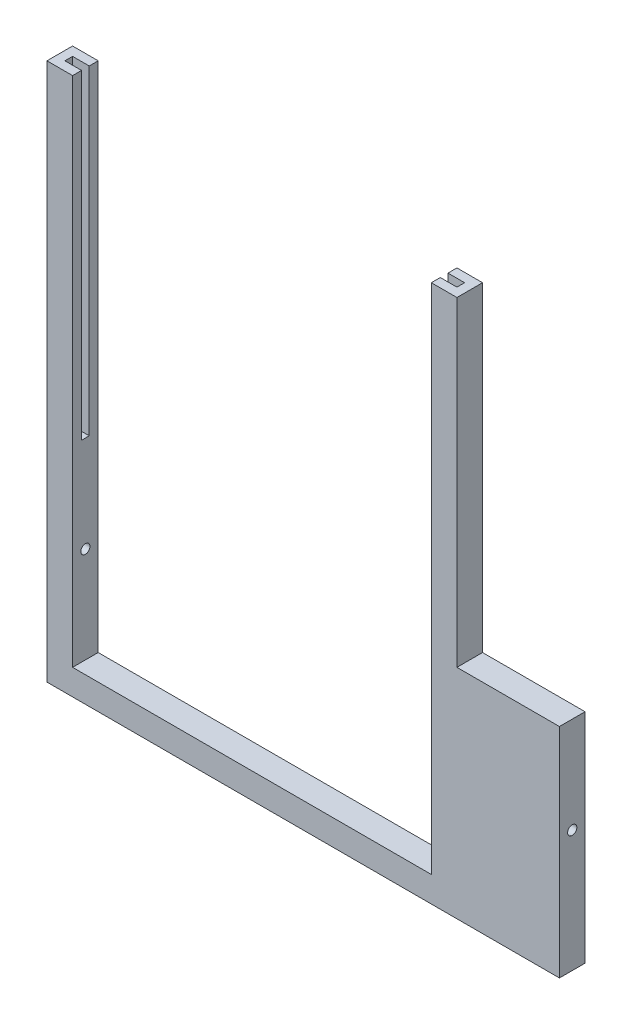
ISO-10303-21;
HEADER;
FILE_DESCRIPTION(('STEP AP214'),'2;1');
FILE_NAME('part.step','',(''),(''),'','','');
FILE_SCHEMA(('AUTOMOTIVE_DESIGN { 1 0 10303 214 1 1 1 1 }'));
ENDSEC;
DATA;
#1=APPLICATION_CONTEXT('core data for automotive mechanical design processes');
#2=APPLICATION_PROTOCOL_DEFINITION('international standard','automotive_design',2000,#1);
#3=PRODUCT_CONTEXT('',#1,'mechanical');
#4=PRODUCT('Part','Part','',(#3));
#5=PRODUCT_RELATED_PRODUCT_CATEGORY('part','',(#4));
#6=PRODUCT_DEFINITION_FORMATION('','',#4);
#7=PRODUCT_DEFINITION_CONTEXT('part definition',#1,'design');
#8=PRODUCT_DEFINITION('design','',#6,#7);
#9=PRODUCT_DEFINITION_SHAPE('','',#8);
#10=(LENGTH_UNIT() NAMED_UNIT(*) SI_UNIT(.MILLI.,.METRE.));
#11=(NAMED_UNIT(*) PLANE_ANGLE_UNIT() SI_UNIT($,.RADIAN.));
#12=(NAMED_UNIT(*) SI_UNIT($,.STERADIAN.) SOLID_ANGLE_UNIT());
#13=UNCERTAINTY_MEASURE_WITH_UNIT(LENGTH_MEASURE(1.E-05),#10,'distance_accuracy_value','');
#14=(GEOMETRIC_REPRESENTATION_CONTEXT(3) GLOBAL_UNCERTAINTY_ASSIGNED_CONTEXT((#13)) GLOBAL_UNIT_ASSIGNED_CONTEXT((#10,
#11,#12)) REPRESENTATION_CONTEXT('',''));
#15=CARTESIAN_POINT('',(0.,0.,0.));
#16=DIRECTION('',(0.,0.,1.));
#17=DIRECTION('',(1.,0.,0.));
#18=AXIS2_PLACEMENT_3D('',#15,#16,#17);
#19=CARTESIAN_POINT('',(30.,17.,2.));
#20=DIRECTION('',(0.,1.,0.));
#21=DIRECTION('',(0.,0.,1.));
#22=AXIS2_PLACEMENT_3D('',#19,#20,#21);
#23=PLANE('',#22);
#24=DIRECTION('',(0.,0.,1.));
#25=VECTOR('',#24,1.);
#26=CARTESIAN_POINT('',(31.3,17.,0.7));
#27=LINE('',#26,#25);
#28=CARTESIAN_POINT('',(31.3,17.,0.7));
#29=VERTEX_POINT('',#28);
#30=CARTESIAN_POINT('',(31.3,17.,1.3));
#31=VERTEX_POINT('',#30);
#32=EDGE_CURVE('E281',#29,#31,#27,.T.);
#33=ORIENTED_EDGE('',*,*,#32,.F.);
#34=DIRECTION('',(1.,0.,0.));
#35=VECTOR('',#34,1.);
#36=CARTESIAN_POINT('',(30.,17.,0.7));
#37=LINE('',#36,#35);
#38=CARTESIAN_POINT('',(30.,17.,0.7));
#39=VERTEX_POINT('',#38);
#40=EDGE_CURVE('E183',#39,#29,#37,.T.);
#41=ORIENTED_EDGE('',*,*,#40,.F.);
#42=DIRECTION('',(0.,0.,-1.));
#43=VECTOR('',#42,1.);
#44=CARTESIAN_POINT('',(30.,17.,2.));
#45=LINE('',#44,#43);
#46=CARTESIAN_POINT('',(30.,17.,1.3));
#47=VERTEX_POINT('',#46);
#48=EDGE_CURVE('E215',#47,#39,#45,.T.);
#49=ORIENTED_EDGE('',*,*,#48,.F.);
#50=DIRECTION('',(-1.,0.,0.));
#51=VECTOR('',#50,1.);
#52=CARTESIAN_POINT('',(31.3,17.,1.3));
#53=LINE('',#52,#51);
#54=EDGE_CURVE('E284',#31,#47,#53,.T.);
#55=ORIENTED_EDGE('',*,*,#54,.F.);
#56=EDGE_LOOP('',(#33,#41,#49,#55));
#57=FACE_BOUND('',#56,.T.);
#58=ADVANCED_FACE('F39',(#57),#23,.T.);
#59=CARTESIAN_POINT('',(0.,17.,2.));
#60=DIRECTION('',(0.,1.,0.));
#61=DIRECTION('',(0.,0.,1.));
#62=AXIS2_PLACEMENT_3D('',#59,#60,#61);
#63=PLANE('',#62);
#64=DIRECTION('',(0.,0.,-1.));
#65=VECTOR('',#64,1.);
#66=CARTESIAN_POINT('',(0.7,17.,1.3));
#67=LINE('',#66,#65);
#68=CARTESIAN_POINT('',(0.7,17.,1.3));
#69=VERTEX_POINT('',#68);
#70=CARTESIAN_POINT('',(0.7,17.,0.7));
#71=VERTEX_POINT('',#70);
#72=EDGE_CURVE('E335',#69,#71,#67,.T.);
#73=ORIENTED_EDGE('',*,*,#72,.F.);
#74=DIRECTION('',(-1.,0.,0.));
#75=VECTOR('',#74,1.);
#76=CARTESIAN_POINT('',(2.,17.,1.3));
#77=LINE('',#76,#75);
#78=CARTESIAN_POINT('',(2.,17.,1.3));
#79=VERTEX_POINT('',#78);
#80=EDGE_CURVE('E301',#79,#69,#77,.T.);
#81=ORIENTED_EDGE('',*,*,#80,.F.);
#82=DIRECTION('',(0.,0.,-1.));
#83=VECTOR('',#82,1.);
#84=CARTESIAN_POINT('',(2.,17.,2.));
#85=LINE('',#84,#83);
#86=CARTESIAN_POINT('',(2.,17.,0.7));
#87=VERTEX_POINT('',#86);
#88=EDGE_CURVE('E223',#79,#87,#85,.T.);
#89=ORIENTED_EDGE('',*,*,#88,.T.);
#90=DIRECTION('',(1.,0.,0.));
#91=VECTOR('',#90,1.);
#92=CARTESIAN_POINT('',(0.7,17.,0.7));
#93=LINE('',#92,#91);
#94=EDGE_CURVE('E307',#71,#87,#93,.T.);
#95=ORIENTED_EDGE('',*,*,#94,.F.);
#96=EDGE_LOOP('',(#73,#81,#89,#95));
#97=FACE_BOUND('',#96,.T.);
#98=ADVANCED_FACE('F41',(#97),#63,.T.);
#99=CARTESIAN_POINT('',(0.,0.,2.));
#100=DIRECTION('',(-1.,0.,0.));
#101=DIRECTION('',(0.,0.,1.));
#102=AXIS2_PLACEMENT_3D('',#99,#100,#101);
#103=PLANE('',#102);
#104=CARTESIAN_POINT('',(0.,9.5,1.));
#105=DIRECTION('',(1.,0.,0.));
#106=DIRECTION('',(0.,0.,-1.));
#107=AXIS2_PLACEMENT_3D('',#104,#105,#106);
#108=CIRCLE('',#107,0.36);
#109=CARTESIAN_POINT('',(0.,9.5,0.64));
#110=VERTEX_POINT('',#109);
#111=EDGE_CURVE('E353',#110,#110,#108,.T.);
#112=ORIENTED_EDGE('',*,*,#111,.T.);
#113=EDGE_LOOP('',(#112));
#114=FACE_BOUND('',#113,.T.);
#115=DIRECTION('',(0.,1.,0.));
#116=VECTOR('',#115,1.);
#117=CARTESIAN_POINT('',(0.,0.,0.));
#118=LINE('',#117,#116);
#119=CARTESIAN_POINT('',(0.,0.,0.));
#120=VERTEX_POINT('',#119);
#121=CARTESIAN_POINT('',(0.,42.,0.));
#122=VERTEX_POINT('',#121);
#123=EDGE_CURVE('E203',#120,#122,#118,.T.);
#124=ORIENTED_EDGE('',*,*,#123,.F.);
#125=DIRECTION('',(0.,0.,-1.));
#126=VECTOR('',#125,1.);
#127=CARTESIAN_POINT('',(0.,0.,2.));
#128=LINE('',#127,#126);
#129=CARTESIAN_POINT('',(0.,0.,2.));
#130=VERTEX_POINT('',#129);
#131=EDGE_CURVE('E11',#130,#120,#128,.T.);
#132=ORIENTED_EDGE('',*,*,#131,.F.);
#133=DIRECTION('',(0.,1.,0.));
#134=VECTOR('',#133,1.);
#135=CARTESIAN_POINT('',(0.,0.,2.));
#136=LINE('',#135,#134);
#137=CARTESIAN_POINT('',(0.,42.,2.));
#138=VERTEX_POINT('',#137);
#139=EDGE_CURVE('E226',#130,#138,#136,.T.);
#140=ORIENTED_EDGE('',*,*,#139,.T.);
#141=DIRECTION('',(0.,0.,1.));
#142=VECTOR('',#141,1.);
#143=CARTESIAN_POINT('',(0.,42.,0.));
#144=LINE('',#143,#142);
#145=EDGE_CURVE('E321',#122,#138,#144,.T.);
#146=ORIENTED_EDGE('',*,*,#145,.F.);
#147=EDGE_LOOP('',(#124,#132,#140,#146));
#148=FACE_BOUND('',#147,.T.);
#149=ADVANCED_FACE('F377',(#114,#148),#103,.T.);
#150=CARTESIAN_POINT('',(0.,0.,2.));
#151=DIRECTION('',(0.,1.,0.));
#152=DIRECTION('',(0.,0.,1.));
#153=AXIS2_PLACEMENT_3D('',#150,#151,#152);
#154=PLANE('',#153);
#155=DIRECTION('',(1.,0.,0.));
#156=VECTOR('',#155,1.);
#157=CARTESIAN_POINT('',(0.,0.,0.));
#158=LINE('',#157,#156);
#159=CARTESIAN_POINT('',(40.,0.,0.));
#160=VERTEX_POINT('',#159);
#161=EDGE_CURVE('E198',#120,#160,#158,.T.);
#162=ORIENTED_EDGE('',*,*,#161,.T.);
#163=DIRECTION('',(0.,0.,-1.));
#164=VECTOR('',#163,1.);
#165=CARTESIAN_POINT('',(40.,0.,2.));
#166=LINE('',#165,#164);
#167=CARTESIAN_POINT('',(40.,0.,2.));
#168=VERTEX_POINT('',#167);
#169=EDGE_CURVE('E49',#168,#160,#166,.T.);
#170=ORIENTED_EDGE('',*,*,#169,.F.);
#171=DIRECTION('',(1.,0.,0.));
#172=VECTOR('',#171,1.);
#173=CARTESIAN_POINT('',(0.,0.,2.));
#174=LINE('',#173,#172);
#175=EDGE_CURVE('E232',#130,#168,#174,.T.);
#176=ORIENTED_EDGE('',*,*,#175,.F.);
#177=ORIENTED_EDGE('',*,*,#131,.T.);
#178=EDGE_LOOP('',(#162,#170,#176,#177));
#179=FACE_BOUND('',#178,.T.);
#180=ADVANCED_FACE('F376',(#179),#154,.F.);
#181=CARTESIAN_POINT('',(40.,0.,2.));
#182=DIRECTION('',(-1.,0.,0.));
#183=DIRECTION('',(0.,0.,1.));
#184=AXIS2_PLACEMENT_3D('',#181,#182,#183);
#185=PLANE('',#184);
#186=CARTESIAN_POINT('',(40.,9.5,1.));
#187=DIRECTION('',(-1.,0.,0.));
#188=DIRECTION('',(0.,0.,1.));
#189=AXIS2_PLACEMENT_3D('',#186,#187,#188);
#190=CIRCLE('',#189,0.36);
#191=CARTESIAN_POINT('',(40.,9.5,1.36));
#192=VERTEX_POINT('',#191);
#193=EDGE_CURVE('E245',#192,#192,#190,.T.);
#194=ORIENTED_EDGE('',*,*,#193,.T.);
#195=EDGE_LOOP('',(#194));
#196=FACE_BOUND('',#195,.T.);
#197=DIRECTION('',(0.,1.,0.));
#198=VECTOR('',#197,1.);
#199=CARTESIAN_POINT('',(40.,0.,0.));
#200=LINE('',#199,#198);
#201=CARTESIAN_POINT('',(40.,17.,0.));
#202=VERTEX_POINT('',#201);
#203=EDGE_CURVE('E189',#160,#202,#200,.T.);
#204=ORIENTED_EDGE('',*,*,#203,.T.);
#205=DIRECTION('',(0.,0.,1.));
#206=VECTOR('',#205,1.);
#207=CARTESIAN_POINT('',(40.,17.,-0.00100000000000013));
#208=LINE('',#207,#206);
#209=CARTESIAN_POINT('',(40.,17.,2.));
#210=VERTEX_POINT('',#209);
#211=EDGE_CURVE('E172',#202,#210,#208,.T.);
#212=ORIENTED_EDGE('',*,*,#211,.T.);
#213=DIRECTION('',(0.,1.,0.));
#214=VECTOR('',#213,1.);
#215=CARTESIAN_POINT('',(40.,0.,2.));
#216=LINE('',#215,#214);
#217=EDGE_CURVE('E238',#168,#210,#216,.T.);
#218=ORIENTED_EDGE('',*,*,#217,.F.);
#219=ORIENTED_EDGE('',*,*,#169,.T.);
#220=EDGE_LOOP('',(#204,#212,#218,#219));
#221=FACE_BOUND('',#220,.T.);
#222=ADVANCED_FACE('F195',(#196,#221),#185,.F.);
#223=CARTESIAN_POINT('',(30.,2.,2.));
#224=DIRECTION('',(-1.,0.,0.));
#225=DIRECTION('',(0.,0.,1.));
#226=AXIS2_PLACEMENT_3D('',#223,#224,#225);
#227=PLANE('',#226);
#228=CARTESIAN_POINT('',(30.,9.5,1.));
#229=DIRECTION('',(-1.,0.,0.));
#230=DIRECTION('',(0.,0.,1.));
#231=AXIS2_PLACEMENT_3D('',#228,#229,#230);
#232=CIRCLE('',#231,0.36);
#233=CARTESIAN_POINT('',(30.,9.5,1.36));
#234=VERTEX_POINT('',#233);
#235=EDGE_CURVE('E357',#234,#234,#232,.T.);
#236=ORIENTED_EDGE('',*,*,#235,.F.);
#237=EDGE_LOOP('',(#236));
#238=FACE_BOUND('',#237,.T.);
#239=DIRECTION('',(0.,1.,0.));
#240=VECTOR('',#239,1.);
#241=CARTESIAN_POINT('',(30.,2.,0.));
#242=LINE('',#241,#240);
#243=CARTESIAN_POINT('',(30.,2.,0.));
#244=VERTEX_POINT('',#243);
#245=CARTESIAN_POINT('',(30.,42.,0.));
#246=VERTEX_POINT('',#245);
#247=EDGE_CURVE('E199',#244,#246,#242,.T.);
#248=ORIENTED_EDGE('',*,*,#247,.F.);
#249=DIRECTION('',(0.,0.,-1.));
#250=VECTOR('',#249,1.);
#251=CARTESIAN_POINT('',(30.,2.,2.));
#252=LINE('',#251,#250);
#253=CARTESIAN_POINT('',(30.,2.,2.));
#254=VERTEX_POINT('',#253);
#255=EDGE_CURVE('E219',#254,#244,#252,.T.);
#256=ORIENTED_EDGE('',*,*,#255,.F.);
#257=DIRECTION('',(0.,1.,0.));
#258=VECTOR('',#257,1.);
#259=CARTESIAN_POINT('',(30.,2.,2.));
#260=LINE('',#259,#258);
#261=CARTESIAN_POINT('',(30.,42.,2.));
#262=VERTEX_POINT('',#261);
#263=EDGE_CURVE('E369',#254,#262,#260,.T.);
#264=ORIENTED_EDGE('',*,*,#263,.T.);
#265=DIRECTION('',(0.,0.,1.));
#266=VECTOR('',#265,1.);
#267=CARTESIAN_POINT('',(30.,42.,1.3));
#268=LINE('',#267,#266);
#269=CARTESIAN_POINT('',(30.,42.,1.3));
#270=VERTEX_POINT('',#269);
#271=EDGE_CURVE('E287',#270,#262,#268,.T.);
#272=ORIENTED_EDGE('',*,*,#271,.F.);
#273=DIRECTION('',(0.,-1.,0.));
#274=VECTOR('',#273,1.);
#275=CARTESIAN_POINT('',(30.,42.,1.3));
#276=LINE('',#275,#274);
#277=EDGE_CURVE('E278',#270,#47,#276,.T.);
#278=ORIENTED_EDGE('',*,*,#277,.T.);
#279=ORIENTED_EDGE('',*,*,#48,.T.);
#280=DIRECTION('',(0.,-1.,0.));
#281=VECTOR('',#280,1.);
#282=CARTESIAN_POINT('',(30.,42.,0.7));
#283=LINE('',#282,#281);
#284=CARTESIAN_POINT('',(30.,42.,0.7));
#285=VERTEX_POINT('',#284);
#286=EDGE_CURVE('E258',#285,#39,#283,.T.);
#287=ORIENTED_EDGE('',*,*,#286,.F.);
#288=DIRECTION('',(0.,0.,1.));
#289=VECTOR('',#288,1.);
#290=CARTESIAN_POINT('',(30.,42.,0.));
#291=LINE('',#290,#289);
#292=EDGE_CURVE('E257',#246,#285,#291,.T.);
#293=ORIENTED_EDGE('',*,*,#292,.F.);
#294=EDGE_LOOP('',(#248,#256,#264,#272,#278,#279,#287,#293));
#295=FACE_BOUND('',#294,.T.);
#296=ADVANCED_FACE('F255',(#238,#295),#227,.T.);
#297=CARTESIAN_POINT('',(2.,2.,2.));
#298=DIRECTION('',(0.,1.,0.));
#299=DIRECTION('',(0.,0.,1.));
#300=AXIS2_PLACEMENT_3D('',#297,#298,#299);
#301=PLANE('',#300);
#302=DIRECTION('',(1.,0.,0.));
#303=VECTOR('',#302,1.);
#304=CARTESIAN_POINT('',(2.,2.,0.));
#305=LINE('',#304,#303);
#306=CARTESIAN_POINT('',(2.,2.,0.));
#307=VERTEX_POINT('',#306);
#308=EDGE_CURVE('E206',#307,#244,#305,.T.);
#309=ORIENTED_EDGE('',*,*,#308,.F.);
#310=DIRECTION('',(0.,0.,-1.));
#311=VECTOR('',#310,1.);
#312=CARTESIAN_POINT('',(2.,2.,2.));
#313=LINE('',#312,#311);
#314=CARTESIAN_POINT('',(2.,2.,2.));
#315=VERTEX_POINT('',#314);
#316=EDGE_CURVE('E89',#315,#307,#313,.T.);
#317=ORIENTED_EDGE('',*,*,#316,.F.);
#318=DIRECTION('',(1.,0.,0.));
#319=VECTOR('',#318,1.);
#320=CARTESIAN_POINT('',(2.,2.,2.));
#321=LINE('',#320,#319);
#322=EDGE_CURVE('E252',#315,#254,#321,.T.);
#323=ORIENTED_EDGE('',*,*,#322,.T.);
#324=ORIENTED_EDGE('',*,*,#255,.T.);
#325=EDGE_LOOP('',(#309,#317,#323,#324));
#326=FACE_BOUND('',#325,.T.);
#327=ADVANCED_FACE('F251',(#326),#301,.T.);
#328=CARTESIAN_POINT('',(2.,17.,2.));
#329=DIRECTION('',(1.,0.,0.));
#330=DIRECTION('',(0.,1.,0.));
#331=AXIS2_PLACEMENT_3D('',#328,#329,#330);
#332=PLANE('',#331);
#333=CARTESIAN_POINT('',(2.,9.5,1.));
#334=DIRECTION('',(1.,0.,0.));
#335=DIRECTION('',(0.,1.,0.));
#336=AXIS2_PLACEMENT_3D('',#333,#334,#335);
#337=CIRCLE('',#336,0.36);
#338=CARTESIAN_POINT('',(2.,9.86,1.));
#339=VERTEX_POINT('',#338);
#340=EDGE_CURVE('E43',#339,#339,#337,.T.);
#341=ORIENTED_EDGE('',*,*,#340,.F.);
#342=EDGE_LOOP('',(#341));
#343=FACE_BOUND('',#342,.T.);
#344=DIRECTION('',(0.,-1.,0.));
#345=VECTOR('',#344,1.);
#346=CARTESIAN_POINT('',(2.,17.,0.));
#347=LINE('',#346,#345);
#348=CARTESIAN_POINT('',(2.,42.,0.));
#349=VERTEX_POINT('',#348);
#350=EDGE_CURVE('E242',#349,#307,#347,.T.);
#351=ORIENTED_EDGE('',*,*,#350,.F.);
#352=DIRECTION('',(0.,0.,-1.));
#353=VECTOR('',#352,1.);
#354=CARTESIAN_POINT('',(2.,42.,0.7));
#355=LINE('',#354,#353);
#356=CARTESIAN_POINT('',(2.,42.,0.7));
#357=VERTEX_POINT('',#356);
#358=EDGE_CURVE('E313',#357,#349,#355,.T.);
#359=ORIENTED_EDGE('',*,*,#358,.F.);
#360=DIRECTION('',(0.,-1.,0.));
#361=VECTOR('',#360,1.);
#362=CARTESIAN_POINT('',(2.,42.,0.7));
#363=LINE('',#362,#361);
#364=EDGE_CURVE('E342',#357,#87,#363,.T.);
#365=ORIENTED_EDGE('',*,*,#364,.T.);
#366=ORIENTED_EDGE('',*,*,#88,.F.);
#367=DIRECTION('',(0.,-1.,0.));
#368=VECTOR('',#367,1.);
#369=CARTESIAN_POINT('',(2.,42.,1.3));
#370=LINE('',#369,#368);
#371=CARTESIAN_POINT('',(2.,42.,1.3));
#372=VERTEX_POINT('',#371);
#373=EDGE_CURVE('E331',#372,#79,#370,.T.);
#374=ORIENTED_EDGE('',*,*,#373,.F.);
#375=DIRECTION('',(0.,0.,-1.));
#376=VECTOR('',#375,1.);
#377=CARTESIAN_POINT('',(2.,42.,2.));
#378=LINE('',#377,#376);
#379=CARTESIAN_POINT('',(2.,42.,2.));
#380=VERTEX_POINT('',#379);
#381=EDGE_CURVE('E328',#380,#372,#378,.T.);
#382=ORIENTED_EDGE('',*,*,#381,.F.);
#383=DIRECTION('',(0.,-1.,0.));
#384=VECTOR('',#383,1.);
#385=CARTESIAN_POINT('',(2.,17.,2.));
#386=LINE('',#385,#384);
#387=EDGE_CURVE('E211',#380,#315,#386,.T.);
#388=ORIENTED_EDGE('',*,*,#387,.T.);
#389=ORIENTED_EDGE('',*,*,#316,.T.);
#390=EDGE_LOOP('',(#351,#359,#365,#366,#374,#382,#388,#389));
#391=FACE_BOUND('',#390,.T.);
#392=ADVANCED_FACE('F382',(#343,#391),#332,.T.);
#393=CARTESIAN_POINT('',(0.,0.,2.));
#394=DIRECTION('',(0.,0.,-1.));
#395=DIRECTION('',(-1.,0.,0.));
#396=AXIS2_PLACEMENT_3D('',#393,#394,#395);
#397=PLANE('',#396);
#398=ORIENTED_EDGE('',*,*,#217,.T.);
#399=DIRECTION('',(1.,0.,0.));
#400=VECTOR('',#399,1.);
#401=CARTESIAN_POINT('',(32.,17.,2.));
#402=LINE('',#401,#400);
#403=CARTESIAN_POINT('',(32.,17.,2.));
#404=VERTEX_POINT('',#403);
#405=EDGE_CURVE('E177',#404,#210,#402,.T.);
#406=ORIENTED_EDGE('',*,*,#405,.F.);
#407=DIRECTION('',(0.,-1.,0.));
#408=VECTOR('',#407,1.);
#409=CARTESIAN_POINT('',(32.,42.,2.));
#410=LINE('',#409,#408);
#411=CARTESIAN_POINT('',(32.,42.,2.));
#412=VERTEX_POINT('',#411);
#413=EDGE_CURVE('E192',#412,#404,#410,.T.);
#414=ORIENTED_EDGE('',*,*,#413,.F.);
#415=DIRECTION('',(1.,0.,0.));
#416=VECTOR('',#415,1.);
#417=CARTESIAN_POINT('',(30.,42.,2.));
#418=LINE('',#417,#416);
#419=EDGE_CURVE('E269',#262,#412,#418,.T.);
#420=ORIENTED_EDGE('',*,*,#419,.F.);
#421=ORIENTED_EDGE('',*,*,#263,.F.);
#422=ORIENTED_EDGE('',*,*,#322,.F.);
#423=ORIENTED_EDGE('',*,*,#387,.F.);
#424=DIRECTION('',(1.,0.,0.));
#425=VECTOR('',#424,1.);
#426=CARTESIAN_POINT('',(0.,42.,2.));
#427=LINE('',#426,#425);
#428=EDGE_CURVE('E324',#138,#380,#427,.T.);
#429=ORIENTED_EDGE('',*,*,#428,.F.);
#430=ORIENTED_EDGE('',*,*,#139,.F.);
#431=ORIENTED_EDGE('',*,*,#175,.T.);
#432=EDGE_LOOP('',(#398,#406,#414,#420,#421,#422,#423,#429,#430,#431));
#433=FACE_BOUND('',#432,.T.);
#434=ADVANCED_FACE('F373',(#433),#397,.F.);
#435=CARTESIAN_POINT('',(0.,0.,0.));
#436=DIRECTION('',(0.,0.,-1.));
#437=DIRECTION('',(-1.,0.,0.));
#438=AXIS2_PLACEMENT_3D('',#435,#436,#437);
#439=PLANE('',#438);
#440=DIRECTION('',(1.,0.,0.));
#441=VECTOR('',#440,1.);
#442=CARTESIAN_POINT('',(32.,17.,0.));
#443=LINE('',#442,#441);
#444=CARTESIAN_POINT('',(32.,17.,0.));
#445=VERTEX_POINT('',#444);
#446=EDGE_CURVE('E175',#445,#202,#443,.T.);
#447=ORIENTED_EDGE('',*,*,#446,.T.);
#448=ORIENTED_EDGE('',*,*,#203,.F.);
#449=ORIENTED_EDGE('',*,*,#161,.F.);
#450=ORIENTED_EDGE('',*,*,#123,.T.);
#451=DIRECTION('',(-1.,0.,0.));
#452=VECTOR('',#451,1.);
#453=CARTESIAN_POINT('',(2.,42.,0.));
#454=LINE('',#453,#452);
#455=EDGE_CURVE('E317',#349,#122,#454,.T.);
#456=ORIENTED_EDGE('',*,*,#455,.F.);
#457=ORIENTED_EDGE('',*,*,#350,.T.);
#458=ORIENTED_EDGE('',*,*,#308,.T.);
#459=ORIENTED_EDGE('',*,*,#247,.T.);
#460=DIRECTION('',(-1.,0.,0.));
#461=VECTOR('',#460,1.);
#462=CARTESIAN_POINT('',(40.,42.,0.));
#463=LINE('',#462,#461);
#464=CARTESIAN_POINT('',(32.,42.,0.));
#465=VERTEX_POINT('',#464);
#466=EDGE_CURVE('E263',#465,#246,#463,.T.);
#467=ORIENTED_EDGE('',*,*,#466,.F.);
#468=DIRECTION('',(0.,-1.,0.));
#469=VECTOR('',#468,1.);
#470=CARTESIAN_POINT('',(32.,42.,0.));
#471=LINE('',#470,#469);
#472=EDGE_CURVE('E57',#465,#445,#471,.T.);
#473=ORIENTED_EDGE('',*,*,#472,.T.);
#474=EDGE_LOOP('',(#447,#448,#449,#450,#456,#457,#458,#459,#467,#473));
#475=FACE_BOUND('',#474,.T.);
#476=ADVANCED_FACE('F188',(#475),#439,.T.);
#477=CARTESIAN_POINT('',(0.,9.5,1.));
#478=DIRECTION('',(1.,0.,0.));
#479=DIRECTION('',(0.,0.,-1.));
#480=AXIS2_PLACEMENT_3D('',#477,#478,#479);
#481=CYLINDRICAL_SURFACE('',#480,0.36);
#482=ORIENTED_EDGE('',*,*,#340,.T.);
#483=EDGE_LOOP('',(#482));
#484=FACE_BOUND('',#483,.T.);
#485=ORIENTED_EDGE('',*,*,#111,.F.);
#486=EDGE_LOOP('',(#485));
#487=FACE_BOUND('',#486,.T.);
#488=ADVANCED_FACE('F426',(#484,#487),#481,.F.);
#489=ORIENTED_EDGE('',*,*,#235,.T.);
#490=EDGE_LOOP('',(#489));
#491=FACE_BOUND('',#490,.T.);
#492=ORIENTED_EDGE('',*,*,#193,.F.);
#493=EDGE_LOOP('',(#492));
#494=FACE_BOUND('',#493,.T.);
#495=ADVANCED_FACE('F429',(#491,#494),#481,.F.);
#496=CARTESIAN_POINT('',(2.,42.,1.3));
#497=DIRECTION('',(0.,0.,1.));
#498=DIRECTION('',(1.,0.,0.));
#499=AXIS2_PLACEMENT_3D('',#496,#497,#498);
#500=PLANE('',#499);
#501=ORIENTED_EDGE('',*,*,#80,.T.);
#502=DIRECTION('',(0.,-1.,0.));
#503=VECTOR('',#502,1.);
#504=CARTESIAN_POINT('',(0.7,42.,1.3));
#505=LINE('',#504,#503);
#506=CARTESIAN_POINT('',(0.7,42.,1.3));
#507=VERTEX_POINT('',#506);
#508=EDGE_CURVE('E350',#507,#69,#505,.T.);
#509=ORIENTED_EDGE('',*,*,#508,.F.);
#510=DIRECTION('',(-1.,0.,0.));
#511=VECTOR('',#510,1.);
#512=CARTESIAN_POINT('',(2.,42.,1.3));
#513=LINE('',#512,#511);
#514=EDGE_CURVE('E302',#372,#507,#513,.T.);
#515=ORIENTED_EDGE('',*,*,#514,.F.);
#516=ORIENTED_EDGE('',*,*,#373,.T.);
#517=EDGE_LOOP('',(#501,#509,#515,#516));
#518=FACE_BOUND('',#517,.T.);
#519=ADVANCED_FACE('F388',(#518),#500,.F.);
#520=CARTESIAN_POINT('',(0.7,42.,1.3));
#521=DIRECTION('',(-1.,0.,0.));
#522=DIRECTION('',(0.,0.,1.));
#523=AXIS2_PLACEMENT_3D('',#520,#521,#522);
#524=PLANE('',#523);
#525=ORIENTED_EDGE('',*,*,#72,.T.);
#526=DIRECTION('',(0.,-1.,0.));
#527=VECTOR('',#526,1.);
#528=CARTESIAN_POINT('',(0.7,42.,0.7));
#529=LINE('',#528,#527);
#530=CARTESIAN_POINT('',(0.7,42.,0.7));
#531=VERTEX_POINT('',#530);
#532=EDGE_CURVE('E346',#531,#71,#529,.T.);
#533=ORIENTED_EDGE('',*,*,#532,.F.);
#534=DIRECTION('',(0.,0.,-1.));
#535=VECTOR('',#534,1.);
#536=CARTESIAN_POINT('',(0.7,42.,1.3));
#537=LINE('',#536,#535);
#538=EDGE_CURVE('E306',#507,#531,#537,.T.);
#539=ORIENTED_EDGE('',*,*,#538,.F.);
#540=ORIENTED_EDGE('',*,*,#508,.T.);
#541=EDGE_LOOP('',(#525,#533,#539,#540));
#542=FACE_BOUND('',#541,.T.);
#543=ADVANCED_FACE('F391',(#542),#524,.F.);
#544=CARTESIAN_POINT('',(0.7,42.,0.7));
#545=DIRECTION('',(0.,0.,-1.));
#546=DIRECTION('',(-1.,0.,0.));
#547=AXIS2_PLACEMENT_3D('',#544,#545,#546);
#548=PLANE('',#547);
#549=ORIENTED_EDGE('',*,*,#94,.T.);
#550=ORIENTED_EDGE('',*,*,#364,.F.);
#551=DIRECTION('',(1.,0.,0.));
#552=VECTOR('',#551,1.);
#553=CARTESIAN_POINT('',(0.7,42.,0.7));
#554=LINE('',#553,#552);
#555=EDGE_CURVE('E310',#531,#357,#554,.T.);
#556=ORIENTED_EDGE('',*,*,#555,.F.);
#557=ORIENTED_EDGE('',*,*,#532,.T.);
#558=EDGE_LOOP('',(#549,#550,#556,#557));
#559=FACE_BOUND('',#558,.T.);
#560=ADVANCED_FACE('F395',(#559),#548,.F.);
#561=CARTESIAN_POINT('',(0.,42.,0.));
#562=DIRECTION('',(0.,-1.,0.));
#563=DIRECTION('',(0.,0.,-1.));
#564=AXIS2_PLACEMENT_3D('',#561,#562,#563);
#565=PLANE('',#564);
#566=ORIENTED_EDGE('',*,*,#514,.T.);
#567=ORIENTED_EDGE('',*,*,#538,.T.);
#568=ORIENTED_EDGE('',*,*,#555,.T.);
#569=ORIENTED_EDGE('',*,*,#358,.T.);
#570=ORIENTED_EDGE('',*,*,#455,.T.);
#571=ORIENTED_EDGE('',*,*,#145,.T.);
#572=ORIENTED_EDGE('',*,*,#428,.T.);
#573=ORIENTED_EDGE('',*,*,#381,.T.);
#574=EDGE_LOOP('',(#566,#567,#568,#569,#570,#571,#572,#573));
#575=FACE_BOUND('',#574,.T.);
#576=ADVANCED_FACE('F379',(#575),#565,.F.);
#577=CARTESIAN_POINT('',(30.,42.,0.7));
#578=DIRECTION('',(0.,0.,-1.));
#579=DIRECTION('',(-1.,0.,0.));
#580=AXIS2_PLACEMENT_3D('',#577,#578,#579);
#581=PLANE('',#580);
#582=ORIENTED_EDGE('',*,*,#40,.T.);
#583=DIRECTION('',(0.,-1.,0.));
#584=VECTOR('',#583,1.);
#585=CARTESIAN_POINT('',(31.3,42.,0.7));
#586=LINE('',#585,#584);
#587=CARTESIAN_POINT('',(31.3,42.,0.7));
#588=VERTEX_POINT('',#587);
#589=EDGE_CURVE('E295',#588,#29,#586,.T.);
#590=ORIENTED_EDGE('',*,*,#589,.F.);
#591=DIRECTION('',(1.,0.,0.));
#592=VECTOR('',#591,1.);
#593=CARTESIAN_POINT('',(30.,42.,0.7));
#594=LINE('',#593,#592);
#595=EDGE_CURVE('E262',#285,#588,#594,.T.);
#596=ORIENTED_EDGE('',*,*,#595,.F.);
#597=ORIENTED_EDGE('',*,*,#286,.T.);
#598=EDGE_LOOP('',(#582,#590,#596,#597));
#599=FACE_BOUND('',#598,.T.);
#600=ADVANCED_FACE('F523',(#599),#581,.F.);
#601=CARTESIAN_POINT('',(31.3,42.,0.7));
#602=DIRECTION('',(1.,0.,0.));
#603=DIRECTION('',(0.,0.,-1.));
#604=AXIS2_PLACEMENT_3D('',#601,#602,#603);
#605=PLANE('',#604);
#606=ORIENTED_EDGE('',*,*,#32,.T.);
#607=DIRECTION('',(0.,-1.,0.));
#608=VECTOR('',#607,1.);
#609=CARTESIAN_POINT('',(31.3,42.,1.3));
#610=LINE('',#609,#608);
#611=CARTESIAN_POINT('',(31.3,42.,1.3));
#612=VERTEX_POINT('',#611);
#613=EDGE_CURVE('E291',#612,#31,#610,.T.);
#614=ORIENTED_EDGE('',*,*,#613,.F.);
#615=DIRECTION('',(0.,0.,1.));
#616=VECTOR('',#615,1.);
#617=CARTESIAN_POINT('',(31.3,42.,0.7));
#618=LINE('',#617,#616);
#619=EDGE_CURVE('E267',#588,#612,#618,.T.);
#620=ORIENTED_EDGE('',*,*,#619,.F.);
#621=ORIENTED_EDGE('',*,*,#589,.T.);
#622=EDGE_LOOP('',(#606,#614,#620,#621));
#623=FACE_BOUND('',#622,.T.);
#624=ADVANCED_FACE('F564',(#623),#605,.F.);
#625=CARTESIAN_POINT('',(31.3,42.,1.3));
#626=DIRECTION('',(0.,0.,1.));
#627=DIRECTION('',(1.,0.,0.));
#628=AXIS2_PLACEMENT_3D('',#625,#626,#627);
#629=PLANE('',#628);
#630=ORIENTED_EDGE('',*,*,#54,.T.);
#631=ORIENTED_EDGE('',*,*,#277,.F.);
#632=DIRECTION('',(-1.,0.,0.));
#633=VECTOR('',#632,1.);
#634=CARTESIAN_POINT('',(31.3,42.,1.3));
#635=LINE('',#634,#633);
#636=EDGE_CURVE('E275',#612,#270,#635,.T.);
#637=ORIENTED_EDGE('',*,*,#636,.F.);
#638=ORIENTED_EDGE('',*,*,#613,.T.);
#639=EDGE_LOOP('',(#630,#631,#637,#638));
#640=FACE_BOUND('',#639,.T.);
#641=ADVANCED_FACE('F573',(#640),#629,.F.);
#642=CARTESIAN_POINT('',(0.,42.,0.));
#643=DIRECTION('',(0.,1.,0.));
#644=DIRECTION('',(0.,0.,1.));
#645=AXIS2_PLACEMENT_3D('',#642,#643,#644);
#646=PLANE('',#645);
#647=DIRECTION('',(0.,0.,1.));
#648=VECTOR('',#647,1.);
#649=CARTESIAN_POINT('',(32.,42.,-0.00100000000000013));
#650=LINE('',#649,#648);
#651=EDGE_CURVE('E612',#465,#412,#650,.T.);
#652=ORIENTED_EDGE('',*,*,#651,.F.);
#653=ORIENTED_EDGE('',*,*,#466,.T.);
#654=ORIENTED_EDGE('',*,*,#292,.T.);
#655=ORIENTED_EDGE('',*,*,#595,.T.);
#656=ORIENTED_EDGE('',*,*,#619,.T.);
#657=ORIENTED_EDGE('',*,*,#636,.T.);
#658=ORIENTED_EDGE('',*,*,#271,.T.);
#659=ORIENTED_EDGE('',*,*,#419,.T.);
#660=EDGE_LOOP('',(#652,#653,#654,#655,#656,#657,#658,#659));
#661=FACE_BOUND('',#660,.T.);
#662=ADVANCED_FACE('F581',(#661),#646,.T.);
#663=CARTESIAN_POINT('',(32.,17.,-0.00100000000000013));
#664=DIRECTION('',(0.,-1.,0.));
#665=DIRECTION('',(0.,0.,-1.));
#666=AXIS2_PLACEMENT_3D('',#663,#664,#665);
#667=PLANE('',#666);
#668=DIRECTION('',(0.,0.,1.));
#669=VECTOR('',#668,1.);
#670=CARTESIAN_POINT('',(32.,17.,-0.00100000000000013));
#671=LINE('',#670,#669);
#672=EDGE_CURVE('E184',#445,#404,#671,.T.);
#673=ORIENTED_EDGE('',*,*,#672,.T.);
#674=ORIENTED_EDGE('',*,*,#405,.T.);
#675=ORIENTED_EDGE('',*,*,#211,.F.);
#676=ORIENTED_EDGE('',*,*,#446,.F.);
#677=EDGE_LOOP('',(#673,#674,#675,#676));
#678=FACE_BOUND('',#677,.T.);
#679=ADVANCED_FACE('F174',(#678),#667,.F.);
#680=CARTESIAN_POINT('',(32.,42.,-0.00100000000000013));
#681=DIRECTION('',(-1.,0.,0.));
#682=DIRECTION('',(0.,0.,1.));
#683=AXIS2_PLACEMENT_3D('',#680,#681,#682);
#684=PLANE('',#683);
#685=ORIENTED_EDGE('',*,*,#651,.T.);
#686=ORIENTED_EDGE('',*,*,#413,.T.);
#687=ORIENTED_EDGE('',*,*,#672,.F.);
#688=ORIENTED_EDGE('',*,*,#472,.F.);
#689=EDGE_LOOP('',(#685,#686,#687,#688));
#690=FACE_BOUND('',#689,.T.);
#691=ADVANCED_FACE('F596',(#690),#684,.F.);
#692=CLOSED_SHELL('',(#58,#98,#149,#180,#222,#296,#327,#392,#434,#476,#488,#495,#519,#543,#560,
#576,#600,#624,#641,#662,#679,#691));
#693=MANIFOLD_SOLID_BREP('B2',#692);
#694=ADVANCED_BREP_SHAPE_REPRESENTATION('',(#18,#693),#14);
#695=SHAPE_DEFINITION_REPRESENTATION(#9,#694);
ENDSEC;
END-ISO-10303-21;
